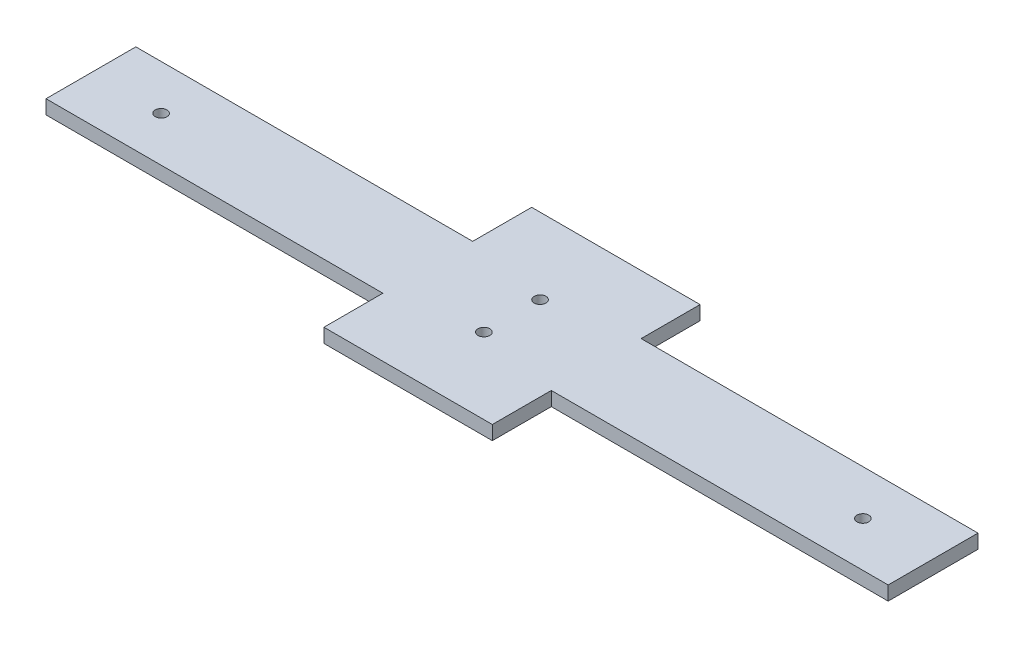
ISO-10303-21;
HEADER;
FILE_DESCRIPTION(('STEP AP214'),'2;1');
FILE_NAME('part.step','',(''),(''),'','','');
FILE_SCHEMA(('AUTOMOTIVE_DESIGN { 1 0 10303 214 1 1 1 1 }'));
ENDSEC;
DATA;
#1=APPLICATION_CONTEXT('core data for automotive mechanical design processes');
#2=APPLICATION_PROTOCOL_DEFINITION('international standard','automotive_design',2000,#1);
#3=PRODUCT_CONTEXT('',#1,'mechanical');
#4=PRODUCT('Part','Part','',(#3));
#5=PRODUCT_RELATED_PRODUCT_CATEGORY('part','',(#4));
#6=PRODUCT_DEFINITION_FORMATION('','',#4);
#7=PRODUCT_DEFINITION_CONTEXT('part definition',#1,'design');
#8=PRODUCT_DEFINITION('design','',#6,#7);
#9=PRODUCT_DEFINITION_SHAPE('','',#8);
#10=(LENGTH_UNIT() NAMED_UNIT(*) SI_UNIT(.MILLI.,.METRE.));
#11=(NAMED_UNIT(*) PLANE_ANGLE_UNIT() SI_UNIT($,.RADIAN.));
#12=(NAMED_UNIT(*) SI_UNIT($,.STERADIAN.) SOLID_ANGLE_UNIT());
#13=UNCERTAINTY_MEASURE_WITH_UNIT(LENGTH_MEASURE(1.E-05),#10,'distance_accuracy_value','');
#14=(GEOMETRIC_REPRESENTATION_CONTEXT(3) GLOBAL_UNCERTAINTY_ASSIGNED_CONTEXT((#13)) GLOBAL_UNIT_ASSIGNED_CONTEXT((#10,
#11,#12)) REPRESENTATION_CONTEXT('',''));
#15=CARTESIAN_POINT('',(0.,0.,0.));
#16=DIRECTION('',(0.,0.,1.));
#17=DIRECTION('',(1.,0.,0.));
#18=AXIS2_PLACEMENT_3D('',#15,#16,#17);
#19=CARTESIAN_POINT('',(0.,5.,0.));
#20=DIRECTION('',(0.,1.,0.));
#21=DIRECTION('',(0.,0.,1.));
#22=AXIS2_PLACEMENT_3D('',#19,#20,#21);
#23=PLANE('',#22);
#24=CARTESIAN_POINT('',(-125.,5.,0.));
#25=DIRECTION('',(0.,-1.,0.));
#26=DIRECTION('',(0.,0.,-1.));
#27=AXIS2_PLACEMENT_3D('',#24,#25,#26);
#28=CIRCLE('',#27,2.09999999999999);
#29=CARTESIAN_POINT('',(-125.,5.,-2.09999999999999));
#30=VERTEX_POINT('',#29);
#31=EDGE_CURVE('E12',#30,#30,#28,.T.);
#32=ORIENTED_EDGE('',*,*,#31,.T.);
#33=EDGE_LOOP('',(#32));
#34=FACE_BOUND('',#33,.T.);
#35=CARTESIAN_POINT('',(0.,5.,-10.));
#36=DIRECTION('',(0.,-1.,0.));
#37=DIRECTION('',(0.,0.,-1.));
#38=AXIS2_PLACEMENT_3D('',#35,#36,#37);
#39=CIRCLE('',#38,2.1);
#40=CARTESIAN_POINT('',(0.,5.,-12.1));
#41=VERTEX_POINT('',#40);
#42=EDGE_CURVE('E239',#41,#41,#39,.T.);
#43=ORIENTED_EDGE('',*,*,#42,.T.);
#44=EDGE_LOOP('',(#43));
#45=FACE_BOUND('',#44,.T.);
#46=CARTESIAN_POINT('',(0.,5.,10.));
#47=DIRECTION('',(0.,-1.,0.));
#48=DIRECTION('',(0.,0.,-1.));
#49=AXIS2_PLACEMENT_3D('',#46,#47,#48);
#50=CIRCLE('',#49,2.1);
#51=CARTESIAN_POINT('',(0.,5.,7.9));
#52=VERTEX_POINT('',#51);
#53=EDGE_CURVE('E233',#52,#52,#50,.T.);
#54=ORIENTED_EDGE('',*,*,#53,.T.);
#55=EDGE_LOOP('',(#54));
#56=FACE_BOUND('',#55,.T.);
#57=CARTESIAN_POINT('',(125.,5.,0.));
#58=DIRECTION('',(0.,-1.,0.));
#59=DIRECTION('',(0.,0.,-1.));
#60=AXIS2_PLACEMENT_3D('',#57,#58,#59);
#61=CIRCLE('',#60,2.09999999999999);
#62=CARTESIAN_POINT('',(125.,5.,-2.09999999999999));
#63=VERTEX_POINT('',#62);
#64=EDGE_CURVE('E227',#63,#63,#61,.T.);
#65=ORIENTED_EDGE('',*,*,#64,.T.);
#66=EDGE_LOOP('',(#65));
#67=FACE_BOUND('',#66,.T.);
#68=DIRECTION('',(0.,0.,-1.));
#69=VECTOR('',#68,1.);
#70=CARTESIAN_POINT('',(-150.,5.,16.));
#71=LINE('',#70,#69);
#72=CARTESIAN_POINT('',(-150.,5.,16.));
#73=VERTEX_POINT('',#72);
#74=CARTESIAN_POINT('',(-150.,5.,-16.));
#75=VERTEX_POINT('',#74);
#76=EDGE_CURVE('E144',#73,#75,#71,.T.);
#77=ORIENTED_EDGE('',*,*,#76,.F.);
#78=DIRECTION('',(-1.,0.,0.));
#79=VECTOR('',#78,1.);
#80=CARTESIAN_POINT('',(-150.,5.,16.));
#81=LINE('',#80,#79);
#82=CARTESIAN_POINT('',(-30.,5.,16.));
#83=VERTEX_POINT('',#82);
#84=EDGE_CURVE('E53',#83,#73,#81,.T.);
#85=ORIENTED_EDGE('',*,*,#84,.F.);
#86=DIRECTION('',(0.,0.,-1.));
#87=VECTOR('',#86,1.);
#88=CARTESIAN_POINT('',(-30.,5.,16.));
#89=LINE('',#88,#87);
#90=CARTESIAN_POINT('',(-30.,5.,37.));
#91=VERTEX_POINT('',#90);
#92=EDGE_CURVE('E171',#91,#83,#89,.T.);
#93=ORIENTED_EDGE('',*,*,#92,.F.);
#94=DIRECTION('',(-1.,0.,0.));
#95=VECTOR('',#94,1.);
#96=CARTESIAN_POINT('',(-30.,5.,37.));
#97=LINE('',#96,#95);
#98=CARTESIAN_POINT('',(30.,5.,37.));
#99=VERTEX_POINT('',#98);
#100=EDGE_CURVE('E168',#99,#91,#97,.T.);
#101=ORIENTED_EDGE('',*,*,#100,.F.);
#102=DIRECTION('',(0.,0.,1.));
#103=VECTOR('',#102,1.);
#104=CARTESIAN_POINT('',(30.,5.,37.));
#105=LINE('',#104,#103);
#106=CARTESIAN_POINT('',(30.,5.,16.));
#107=VERTEX_POINT('',#106);
#108=EDGE_CURVE('E165',#107,#99,#105,.T.);
#109=ORIENTED_EDGE('',*,*,#108,.F.);
#110=DIRECTION('',(-1.,0.,0.));
#111=VECTOR('',#110,1.);
#112=CARTESIAN_POINT('',(30.,5.,16.));
#113=LINE('',#112,#111);
#114=CARTESIAN_POINT('',(150.,5.,16.));
#115=VERTEX_POINT('',#114);
#116=EDGE_CURVE('E162',#115,#107,#113,.T.);
#117=ORIENTED_EDGE('',*,*,#116,.F.);
#118=DIRECTION('',(0.,0.,1.));
#119=VECTOR('',#118,1.);
#120=CARTESIAN_POINT('',(150.,5.,-16.));
#121=LINE('',#120,#119);
#122=CARTESIAN_POINT('',(150.,5.,-16.));
#123=VERTEX_POINT('',#122);
#124=EDGE_CURVE('E159',#123,#115,#121,.T.);
#125=ORIENTED_EDGE('',*,*,#124,.F.);
#126=DIRECTION('',(1.,0.,0.));
#127=VECTOR('',#126,1.);
#128=CARTESIAN_POINT('',(30.,5.,-16.));
#129=LINE('',#128,#127);
#130=CARTESIAN_POINT('',(30.,5.,-16.));
#131=VERTEX_POINT('',#130);
#132=EDGE_CURVE('E156',#131,#123,#129,.T.);
#133=ORIENTED_EDGE('',*,*,#132,.F.);
#134=DIRECTION('',(0.,0.,1.));
#135=VECTOR('',#134,1.);
#136=CARTESIAN_POINT('',(30.,5.,-16.));
#137=LINE('',#136,#135);
#138=CARTESIAN_POINT('',(30.,5.,-37.));
#139=VERTEX_POINT('',#138);
#140=EDGE_CURVE('E150',#139,#131,#137,.T.);
#141=ORIENTED_EDGE('',*,*,#140,.F.);
#142=DIRECTION('',(1.,0.,0.));
#143=VECTOR('',#142,1.);
#144=CARTESIAN_POINT('',(30.,5.,-37.));
#145=LINE('',#144,#143);
#146=CARTESIAN_POINT('',(-30.,5.,-37.));
#147=VERTEX_POINT('',#146);
#148=EDGE_CURVE('E148',#147,#139,#145,.T.);
#149=ORIENTED_EDGE('',*,*,#148,.F.);
#150=DIRECTION('',(0.,0.,-1.));
#151=VECTOR('',#150,1.);
#152=CARTESIAN_POINT('',(-30.,5.,-37.));
#153=LINE('',#152,#151);
#154=CARTESIAN_POINT('',(-30.,5.,-16.));
#155=VERTEX_POINT('',#154);
#156=EDGE_CURVE('E131',#155,#147,#153,.T.);
#157=ORIENTED_EDGE('',*,*,#156,.F.);
#158=DIRECTION('',(1.,0.,0.));
#159=VECTOR('',#158,1.);
#160=CARTESIAN_POINT('',(-150.,5.,-16.));
#161=LINE('',#160,#159);
#162=EDGE_CURVE('E139',#75,#155,#161,.T.);
#163=ORIENTED_EDGE('',*,*,#162,.F.);
#164=EDGE_LOOP('',(#77,#85,#93,#101,#109,#117,#125,#133,#141,#149,#157,#163));
#165=FACE_BOUND('',#164,.T.);
#166=ADVANCED_FACE('F38',(#34,#45,#56,#67,#165),#23,.T.);
#167=CARTESIAN_POINT('',(0.,0.,0.));
#168=DIRECTION('',(0.,1.,0.));
#169=DIRECTION('',(0.,0.,1.));
#170=AXIS2_PLACEMENT_3D('',#167,#168,#169);
#171=PLANE('',#170);
#172=CARTESIAN_POINT('',(-125.,0.,0.));
#173=DIRECTION('',(0.,-1.,0.));
#174=DIRECTION('',(0.,0.,-1.));
#175=AXIS2_PLACEMENT_3D('',#172,#173,#174);
#176=CIRCLE('',#175,2.09999999999999);
#177=CARTESIAN_POINT('',(-125.,0.,-2.09999999999999));
#178=VERTEX_POINT('',#177);
#179=EDGE_CURVE('E42',#178,#178,#176,.T.);
#180=ORIENTED_EDGE('',*,*,#179,.F.);
#181=EDGE_LOOP('',(#180));
#182=FACE_BOUND('',#181,.T.);
#183=CARTESIAN_POINT('',(0.,0.,-10.));
#184=DIRECTION('',(0.,-1.,0.));
#185=DIRECTION('',(0.,0.,-1.));
#186=AXIS2_PLACEMENT_3D('',#183,#184,#185);
#187=CIRCLE('',#186,2.1);
#188=CARTESIAN_POINT('',(0.,0.,-12.1));
#189=VERTEX_POINT('',#188);
#190=EDGE_CURVE('E209',#189,#189,#187,.T.);
#191=ORIENTED_EDGE('',*,*,#190,.F.);
#192=EDGE_LOOP('',(#191));
#193=FACE_BOUND('',#192,.T.);
#194=CARTESIAN_POINT('',(0.,0.,10.));
#195=DIRECTION('',(0.,-1.,0.));
#196=DIRECTION('',(0.,0.,-1.));
#197=AXIS2_PLACEMENT_3D('',#194,#195,#196);
#198=CIRCLE('',#197,2.1);
#199=CARTESIAN_POINT('',(0.,0.,7.9));
#200=VERTEX_POINT('',#199);
#201=EDGE_CURVE('E236',#200,#200,#198,.T.);
#202=ORIENTED_EDGE('',*,*,#201,.F.);
#203=EDGE_LOOP('',(#202));
#204=FACE_BOUND('',#203,.T.);
#205=CARTESIAN_POINT('',(125.,0.,0.));
#206=DIRECTION('',(0.,-1.,0.));
#207=DIRECTION('',(0.,0.,-1.));
#208=AXIS2_PLACEMENT_3D('',#205,#206,#207);
#209=CIRCLE('',#208,2.09999999999999);
#210=CARTESIAN_POINT('',(125.,0.,-2.09999999999999));
#211=VERTEX_POINT('',#210);
#212=EDGE_CURVE('E230',#211,#211,#209,.T.);
#213=ORIENTED_EDGE('',*,*,#212,.F.);
#214=EDGE_LOOP('',(#213));
#215=FACE_BOUND('',#214,.T.);
#216=DIRECTION('',(-1.,0.,0.));
#217=VECTOR('',#216,1.);
#218=CARTESIAN_POINT('',(-150.,0.,16.));
#219=LINE('',#218,#217);
#220=CARTESIAN_POINT('',(-30.,0.,16.));
#221=VERTEX_POINT('',#220);
#222=CARTESIAN_POINT('',(-150.,0.,16.));
#223=VERTEX_POINT('',#222);
#224=EDGE_CURVE('E175',#221,#223,#219,.T.);
#225=ORIENTED_EDGE('',*,*,#224,.T.);
#226=DIRECTION('',(0.,0.,-1.));
#227=VECTOR('',#226,1.);
#228=CARTESIAN_POINT('',(-150.,0.,16.));
#229=LINE('',#228,#227);
#230=CARTESIAN_POINT('',(-150.,0.,-16.));
#231=VERTEX_POINT('',#230);
#232=EDGE_CURVE('E178',#223,#231,#229,.T.);
#233=ORIENTED_EDGE('',*,*,#232,.T.);
#234=DIRECTION('',(1.,0.,0.));
#235=VECTOR('',#234,1.);
#236=CARTESIAN_POINT('',(-150.,0.,-16.));
#237=LINE('',#236,#235);
#238=CARTESIAN_POINT('',(-30.,0.,-16.));
#239=VERTEX_POINT('',#238);
#240=EDGE_CURVE('E61',#231,#239,#237,.T.);
#241=ORIENTED_EDGE('',*,*,#240,.T.);
#242=DIRECTION('',(0.,0.,-1.));
#243=VECTOR('',#242,1.);
#244=CARTESIAN_POINT('',(-30.,0.,-37.));
#245=LINE('',#244,#243);
#246=CARTESIAN_POINT('',(-30.,0.,-37.));
#247=VERTEX_POINT('',#246);
#248=EDGE_CURVE('E134',#239,#247,#245,.T.);
#249=ORIENTED_EDGE('',*,*,#248,.T.);
#250=DIRECTION('',(1.,0.,0.));
#251=VECTOR('',#250,1.);
#252=CARTESIAN_POINT('',(30.,0.,-37.));
#253=LINE('',#252,#251);
#254=CARTESIAN_POINT('',(30.,0.,-37.));
#255=VERTEX_POINT('',#254);
#256=EDGE_CURVE('E183',#247,#255,#253,.T.);
#257=ORIENTED_EDGE('',*,*,#256,.T.);
#258=DIRECTION('',(0.,0.,1.));
#259=VECTOR('',#258,1.);
#260=CARTESIAN_POINT('',(30.,0.,-16.));
#261=LINE('',#260,#259);
#262=CARTESIAN_POINT('',(30.,0.,-16.));
#263=VERTEX_POINT('',#262);
#264=EDGE_CURVE('E186',#255,#263,#261,.T.);
#265=ORIENTED_EDGE('',*,*,#264,.T.);
#266=DIRECTION('',(1.,0.,0.));
#267=VECTOR('',#266,1.);
#268=CARTESIAN_POINT('',(30.,0.,-16.));
#269=LINE('',#268,#267);
#270=CARTESIAN_POINT('',(150.,0.,-16.));
#271=VERTEX_POINT('',#270);
#272=EDGE_CURVE('E189',#263,#271,#269,.T.);
#273=ORIENTED_EDGE('',*,*,#272,.T.);
#274=DIRECTION('',(0.,0.,1.));
#275=VECTOR('',#274,1.);
#276=CARTESIAN_POINT('',(150.,0.,-16.));
#277=LINE('',#276,#275);
#278=CARTESIAN_POINT('',(150.,0.,16.));
#279=VERTEX_POINT('',#278);
#280=EDGE_CURVE('E192',#271,#279,#277,.T.);
#281=ORIENTED_EDGE('',*,*,#280,.T.);
#282=DIRECTION('',(-1.,0.,0.));
#283=VECTOR('',#282,1.);
#284=CARTESIAN_POINT('',(30.,0.,16.));
#285=LINE('',#284,#283);
#286=CARTESIAN_POINT('',(30.,0.,16.));
#287=VERTEX_POINT('',#286);
#288=EDGE_CURVE('E195',#279,#287,#285,.T.);
#289=ORIENTED_EDGE('',*,*,#288,.T.);
#290=DIRECTION('',(0.,0.,1.));
#291=VECTOR('',#290,1.);
#292=CARTESIAN_POINT('',(30.,0.,37.));
#293=LINE('',#292,#291);
#294=CARTESIAN_POINT('',(30.,0.,37.));
#295=VERTEX_POINT('',#294);
#296=EDGE_CURVE('E198',#287,#295,#293,.T.);
#297=ORIENTED_EDGE('',*,*,#296,.T.);
#298=DIRECTION('',(-1.,0.,0.));
#299=VECTOR('',#298,1.);
#300=CARTESIAN_POINT('',(-30.,0.,37.));
#301=LINE('',#300,#299);
#302=CARTESIAN_POINT('',(-30.,0.,37.));
#303=VERTEX_POINT('',#302);
#304=EDGE_CURVE('E201',#295,#303,#301,.T.);
#305=ORIENTED_EDGE('',*,*,#304,.T.);
#306=DIRECTION('',(0.,0.,-1.));
#307=VECTOR('',#306,1.);
#308=CARTESIAN_POINT('',(-30.,0.,16.));
#309=LINE('',#308,#307);
#310=EDGE_CURVE('E204',#303,#221,#309,.T.);
#311=ORIENTED_EDGE('',*,*,#310,.T.);
#312=EDGE_LOOP('',(#225,#233,#241,#249,#257,#265,#273,#281,#289,#297,#305,#311));
#313=FACE_BOUND('',#312,.T.);
#314=ADVANCED_FACE('F40',(#182,#193,#204,#215,#313),#171,.F.);
#315=CARTESIAN_POINT('',(-125.,5.,0.));
#316=DIRECTION('',(0.,-1.,0.));
#317=DIRECTION('',(0.,0.,-1.));
#318=AXIS2_PLACEMENT_3D('',#315,#316,#317);
#319=CYLINDRICAL_SURFACE('',#318,2.09999999999999);
#320=ORIENTED_EDGE('',*,*,#31,.F.);
#321=EDGE_LOOP('',(#320));
#322=FACE_BOUND('',#321,.T.);
#323=ORIENTED_EDGE('',*,*,#179,.T.);
#324=EDGE_LOOP('',(#323));
#325=FACE_BOUND('',#324,.T.);
#326=ADVANCED_FACE('F249',(#322,#325),#319,.F.);
#327=CARTESIAN_POINT('',(0.,5.,-10.));
#328=DIRECTION('',(0.,-1.,0.));
#329=DIRECTION('',(0.,0.,-1.));
#330=AXIS2_PLACEMENT_3D('',#327,#328,#329);
#331=CYLINDRICAL_SURFACE('',#330,2.1);
#332=ORIENTED_EDGE('',*,*,#42,.F.);
#333=EDGE_LOOP('',(#332));
#334=FACE_BOUND('',#333,.T.);
#335=ORIENTED_EDGE('',*,*,#190,.T.);
#336=EDGE_LOOP('',(#335));
#337=FACE_BOUND('',#336,.T.);
#338=ADVANCED_FACE('F245',(#334,#337),#331,.F.);
#339=CARTESIAN_POINT('',(0.,5.,10.));
#340=DIRECTION('',(0.,-1.,0.));
#341=DIRECTION('',(0.,0.,-1.));
#342=AXIS2_PLACEMENT_3D('',#339,#340,#341);
#343=CYLINDRICAL_SURFACE('',#342,2.1);
#344=ORIENTED_EDGE('',*,*,#53,.F.);
#345=EDGE_LOOP('',(#344));
#346=FACE_BOUND('',#345,.T.);
#347=ORIENTED_EDGE('',*,*,#201,.T.);
#348=EDGE_LOOP('',(#347));
#349=FACE_BOUND('',#348,.T.);
#350=ADVANCED_FACE('F310',(#346,#349),#343,.F.);
#351=CARTESIAN_POINT('',(125.,5.,0.));
#352=DIRECTION('',(0.,-1.,0.));
#353=DIRECTION('',(0.,0.,-1.));
#354=AXIS2_PLACEMENT_3D('',#351,#352,#353);
#355=CYLINDRICAL_SURFACE('',#354,2.09999999999999);
#356=ORIENTED_EDGE('',*,*,#64,.F.);
#357=EDGE_LOOP('',(#356));
#358=FACE_BOUND('',#357,.T.);
#359=ORIENTED_EDGE('',*,*,#212,.T.);
#360=EDGE_LOOP('',(#359));
#361=FACE_BOUND('',#360,.T.);
#362=ADVANCED_FACE('F314',(#358,#361),#355,.F.);
#363=CARTESIAN_POINT('',(-150.,5.,16.));
#364=DIRECTION('',(0.,0.,1.));
#365=DIRECTION('',(1.,0.,0.));
#366=AXIS2_PLACEMENT_3D('',#363,#364,#365);
#367=PLANE('',#366);
#368=ORIENTED_EDGE('',*,*,#224,.F.);
#369=DIRECTION('',(0.,-1.,0.));
#370=VECTOR('',#369,1.);
#371=CARTESIAN_POINT('',(-30.,5.,16.));
#372=LINE('',#371,#370);
#373=EDGE_CURVE('E207',#83,#221,#372,.T.);
#374=ORIENTED_EDGE('',*,*,#373,.F.);
#375=ORIENTED_EDGE('',*,*,#84,.T.);
#376=DIRECTION('',(0.,-1.,0.));
#377=VECTOR('',#376,1.);
#378=CARTESIAN_POINT('',(-150.,5.,16.));
#379=LINE('',#378,#377);
#380=EDGE_CURVE('E174',#73,#223,#379,.T.);
#381=ORIENTED_EDGE('',*,*,#380,.T.);
#382=EDGE_LOOP('',(#368,#374,#375,#381));
#383=FACE_BOUND('',#382,.T.);
#384=ADVANCED_FACE('F258',(#383),#367,.T.);
#385=CARTESIAN_POINT('',(-30.,5.,16.));
#386=DIRECTION('',(-1.,0.,0.));
#387=DIRECTION('',(0.,0.,1.));
#388=AXIS2_PLACEMENT_3D('',#385,#386,#387);
#389=PLANE('',#388);
#390=ORIENTED_EDGE('',*,*,#310,.F.);
#391=DIRECTION('',(0.,-1.,0.));
#392=VECTOR('',#391,1.);
#393=CARTESIAN_POINT('',(-30.,5.,37.));
#394=LINE('',#393,#392);
#395=EDGE_CURVE('E210',#91,#303,#394,.T.);
#396=ORIENTED_EDGE('',*,*,#395,.F.);
#397=ORIENTED_EDGE('',*,*,#92,.T.);
#398=ORIENTED_EDGE('',*,*,#373,.T.);
#399=EDGE_LOOP('',(#390,#396,#397,#398));
#400=FACE_BOUND('',#399,.T.);
#401=ADVANCED_FACE('F266',(#400),#389,.T.);
#402=CARTESIAN_POINT('',(-30.,5.,37.));
#403=DIRECTION('',(0.,0.,1.));
#404=DIRECTION('',(1.,0.,0.));
#405=AXIS2_PLACEMENT_3D('',#402,#403,#404);
#406=PLANE('',#405);
#407=ORIENTED_EDGE('',*,*,#304,.F.);
#408=DIRECTION('',(0.,-1.,0.));
#409=VECTOR('',#408,1.);
#410=CARTESIAN_POINT('',(30.,5.,37.));
#411=LINE('',#410,#409);
#412=EDGE_CURVE('E212',#99,#295,#411,.T.);
#413=ORIENTED_EDGE('',*,*,#412,.F.);
#414=ORIENTED_EDGE('',*,*,#100,.T.);
#415=ORIENTED_EDGE('',*,*,#395,.T.);
#416=EDGE_LOOP('',(#407,#413,#414,#415));
#417=FACE_BOUND('',#416,.T.);
#418=ADVANCED_FACE('F269',(#417),#406,.T.);
#419=CARTESIAN_POINT('',(30.,5.,37.));
#420=DIRECTION('',(1.,0.,0.));
#421=DIRECTION('',(0.,0.,-1.));
#422=AXIS2_PLACEMENT_3D('',#419,#420,#421);
#423=PLANE('',#422);
#424=ORIENTED_EDGE('',*,*,#296,.F.);
#425=DIRECTION('',(0.,-1.,0.));
#426=VECTOR('',#425,1.);
#427=CARTESIAN_POINT('',(30.,5.,16.));
#428=LINE('',#427,#426);
#429=EDGE_CURVE('E214',#107,#287,#428,.T.);
#430=ORIENTED_EDGE('',*,*,#429,.F.);
#431=ORIENTED_EDGE('',*,*,#108,.T.);
#432=ORIENTED_EDGE('',*,*,#412,.T.);
#433=EDGE_LOOP('',(#424,#430,#431,#432));
#434=FACE_BOUND('',#433,.T.);
#435=ADVANCED_FACE('F272',(#434),#423,.T.);
#436=CARTESIAN_POINT('',(30.,5.,16.));
#437=DIRECTION('',(0.,0.,1.));
#438=DIRECTION('',(1.,0.,0.));
#439=AXIS2_PLACEMENT_3D('',#436,#437,#438);
#440=PLANE('',#439);
#441=ORIENTED_EDGE('',*,*,#288,.F.);
#442=DIRECTION('',(0.,-1.,0.));
#443=VECTOR('',#442,1.);
#444=CARTESIAN_POINT('',(150.,5.,16.));
#445=LINE('',#444,#443);
#446=EDGE_CURVE('E216',#115,#279,#445,.T.);
#447=ORIENTED_EDGE('',*,*,#446,.F.);
#448=ORIENTED_EDGE('',*,*,#116,.T.);
#449=ORIENTED_EDGE('',*,*,#429,.T.);
#450=EDGE_LOOP('',(#441,#447,#448,#449));
#451=FACE_BOUND('',#450,.T.);
#452=ADVANCED_FACE('F278',(#451),#440,.T.);
#453=CARTESIAN_POINT('',(150.,5.,-16.));
#454=DIRECTION('',(1.,0.,0.));
#455=DIRECTION('',(0.,0.,-1.));
#456=AXIS2_PLACEMENT_3D('',#453,#454,#455);
#457=PLANE('',#456);
#458=ORIENTED_EDGE('',*,*,#280,.F.);
#459=DIRECTION('',(0.,-1.,0.));
#460=VECTOR('',#459,1.);
#461=CARTESIAN_POINT('',(150.,5.,-16.));
#462=LINE('',#461,#460);
#463=EDGE_CURVE('E218',#123,#271,#462,.T.);
#464=ORIENTED_EDGE('',*,*,#463,.F.);
#465=ORIENTED_EDGE('',*,*,#124,.T.);
#466=ORIENTED_EDGE('',*,*,#446,.T.);
#467=EDGE_LOOP('',(#458,#464,#465,#466));
#468=FACE_BOUND('',#467,.T.);
#469=ADVANCED_FACE('F281',(#468),#457,.T.);
#470=CARTESIAN_POINT('',(30.,5.,-16.));
#471=DIRECTION('',(0.,0.,-1.));
#472=DIRECTION('',(-1.,0.,0.));
#473=AXIS2_PLACEMENT_3D('',#470,#471,#472);
#474=PLANE('',#473);
#475=ORIENTED_EDGE('',*,*,#272,.F.);
#476=DIRECTION('',(0.,-1.,0.));
#477=VECTOR('',#476,1.);
#478=CARTESIAN_POINT('',(30.,5.,-16.));
#479=LINE('',#478,#477);
#480=EDGE_CURVE('E220',#131,#263,#479,.T.);
#481=ORIENTED_EDGE('',*,*,#480,.F.);
#482=ORIENTED_EDGE('',*,*,#132,.T.);
#483=ORIENTED_EDGE('',*,*,#463,.T.);
#484=EDGE_LOOP('',(#475,#481,#482,#483));
#485=FACE_BOUND('',#484,.T.);
#486=ADVANCED_FACE('F284',(#485),#474,.T.);
#487=CARTESIAN_POINT('',(30.,5.,-16.));
#488=DIRECTION('',(1.,0.,0.));
#489=DIRECTION('',(0.,0.,-1.));
#490=AXIS2_PLACEMENT_3D('',#487,#488,#489);
#491=PLANE('',#490);
#492=ORIENTED_EDGE('',*,*,#264,.F.);
#493=DIRECTION('',(0.,-1.,0.));
#494=VECTOR('',#493,1.);
#495=CARTESIAN_POINT('',(30.,5.,-37.));
#496=LINE('',#495,#494);
#497=EDGE_CURVE('E222',#139,#255,#496,.T.);
#498=ORIENTED_EDGE('',*,*,#497,.F.);
#499=ORIENTED_EDGE('',*,*,#140,.T.);
#500=ORIENTED_EDGE('',*,*,#480,.T.);
#501=EDGE_LOOP('',(#492,#498,#499,#500));
#502=FACE_BOUND('',#501,.T.);
#503=ADVANCED_FACE('F287',(#502),#491,.T.);
#504=CARTESIAN_POINT('',(30.,5.,-37.));
#505=DIRECTION('',(0.,0.,-1.));
#506=DIRECTION('',(-1.,0.,0.));
#507=AXIS2_PLACEMENT_3D('',#504,#505,#506);
#508=PLANE('',#507);
#509=ORIENTED_EDGE('',*,*,#256,.F.);
#510=DIRECTION('',(0.,-1.,0.));
#511=VECTOR('',#510,1.);
#512=CARTESIAN_POINT('',(-30.,5.,-37.));
#513=LINE('',#512,#511);
#514=EDGE_CURVE('E135',#147,#247,#513,.T.);
#515=ORIENTED_EDGE('',*,*,#514,.F.);
#516=ORIENTED_EDGE('',*,*,#148,.T.);
#517=ORIENTED_EDGE('',*,*,#497,.T.);
#518=EDGE_LOOP('',(#509,#515,#516,#517));
#519=FACE_BOUND('',#518,.T.);
#520=ADVANCED_FACE('F290',(#519),#508,.T.);
#521=CARTESIAN_POINT('',(-30.,5.,-37.));
#522=DIRECTION('',(-1.,0.,0.));
#523=DIRECTION('',(0.,0.,1.));
#524=AXIS2_PLACEMENT_3D('',#521,#522,#523);
#525=PLANE('',#524);
#526=ORIENTED_EDGE('',*,*,#248,.F.);
#527=DIRECTION('',(0.,-1.,0.));
#528=VECTOR('',#527,1.);
#529=CARTESIAN_POINT('',(-30.,5.,-16.));
#530=LINE('',#529,#528);
#531=EDGE_CURVE('E127',#155,#239,#530,.T.);
#532=ORIENTED_EDGE('',*,*,#531,.F.);
#533=ORIENTED_EDGE('',*,*,#156,.T.);
#534=ORIENTED_EDGE('',*,*,#514,.T.);
#535=EDGE_LOOP('',(#526,#532,#533,#534));
#536=FACE_BOUND('',#535,.T.);
#537=ADVANCED_FACE('F129',(#536),#525,.T.);
#538=CARTESIAN_POINT('',(-150.,5.,-16.));
#539=DIRECTION('',(0.,0.,-1.));
#540=DIRECTION('',(-1.,0.,0.));
#541=AXIS2_PLACEMENT_3D('',#538,#539,#540);
#542=PLANE('',#541);
#543=ORIENTED_EDGE('',*,*,#240,.F.);
#544=DIRECTION('',(0.,-1.,0.));
#545=VECTOR('',#544,1.);
#546=CARTESIAN_POINT('',(-150.,5.,-16.));
#547=LINE('',#546,#545);
#548=EDGE_CURVE('E136',#75,#231,#547,.T.);
#549=ORIENTED_EDGE('',*,*,#548,.F.);
#550=ORIENTED_EDGE('',*,*,#162,.T.);
#551=ORIENTED_EDGE('',*,*,#531,.T.);
#552=EDGE_LOOP('',(#543,#549,#550,#551));
#553=FACE_BOUND('',#552,.T.);
#554=ADVANCED_FACE('F140',(#553),#542,.T.);
#555=CARTESIAN_POINT('',(-150.,5.,16.));
#556=DIRECTION('',(-1.,0.,0.));
#557=DIRECTION('',(0.,0.,1.));
#558=AXIS2_PLACEMENT_3D('',#555,#556,#557);
#559=PLANE('',#558);
#560=ORIENTED_EDGE('',*,*,#232,.F.);
#561=ORIENTED_EDGE('',*,*,#380,.F.);
#562=ORIENTED_EDGE('',*,*,#76,.T.);
#563=ORIENTED_EDGE('',*,*,#548,.T.);
#564=EDGE_LOOP('',(#560,#561,#562,#563));
#565=FACE_BOUND('',#564,.T.);
#566=ADVANCED_FACE('F260',(#565),#559,.T.);
#567=CLOSED_SHELL('',(#166,#314,#326,#338,#350,#362,#384,#401,#418,#435,#452,#469,#486,#503,
#520,#537,#554,#566));
#568=MANIFOLD_SOLID_BREP('B2',#567);
#569=ADVANCED_BREP_SHAPE_REPRESENTATION('',(#18,#568),#14);
#570=SHAPE_DEFINITION_REPRESENTATION(#9,#569);
ENDSEC;
END-ISO-10303-21;
